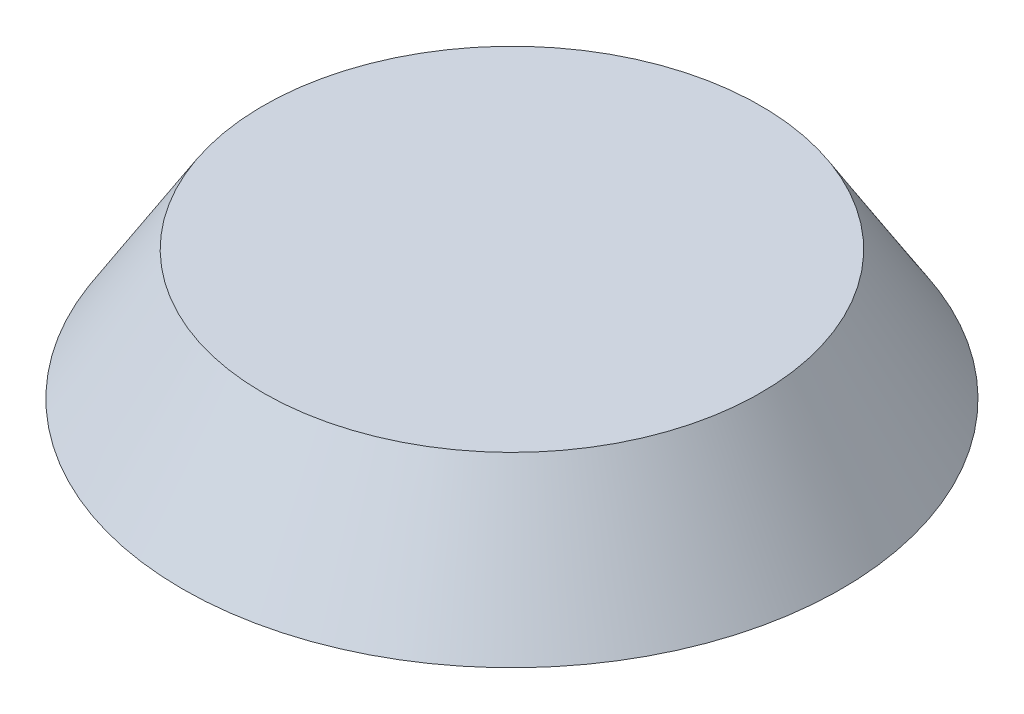
ISO-10303-21;
HEADER;
FILE_DESCRIPTION(('STEP AP214'),'2;1');
FILE_NAME('part.step','',(''),(''),'','','');
FILE_SCHEMA(('AUTOMOTIVE_DESIGN { 1 0 10303 214 1 1 1 1 }'));
ENDSEC;
DATA;
#1=APPLICATION_CONTEXT('core data for automotive mechanical design processes');
#2=APPLICATION_PROTOCOL_DEFINITION('international standard','automotive_design',2000,#1);
#3=PRODUCT_CONTEXT('',#1,'mechanical');
#4=PRODUCT('Part','Part','',(#3));
#5=PRODUCT_RELATED_PRODUCT_CATEGORY('part','',(#4));
#6=PRODUCT_DEFINITION_FORMATION('','',#4);
#7=PRODUCT_DEFINITION_CONTEXT('part definition',#1,'design');
#8=PRODUCT_DEFINITION('design','',#6,#7);
#9=PRODUCT_DEFINITION_SHAPE('','',#8);
#10=(LENGTH_UNIT() NAMED_UNIT(*) SI_UNIT(.MILLI.,.METRE.));
#11=(NAMED_UNIT(*) PLANE_ANGLE_UNIT() SI_UNIT($,.RADIAN.));
#12=(NAMED_UNIT(*) SI_UNIT($,.STERADIAN.) SOLID_ANGLE_UNIT());
#13=UNCERTAINTY_MEASURE_WITH_UNIT(LENGTH_MEASURE(1.E-05),#10,'distance_accuracy_value','');
#14=(GEOMETRIC_REPRESENTATION_CONTEXT(3) GLOBAL_UNCERTAINTY_ASSIGNED_CONTEXT((#13)) GLOBAL_UNIT_ASSIGNED_CONTEXT((#10,
#11,#12)) REPRESENTATION_CONTEXT('',''));
#15=CARTESIAN_POINT('',(0.,0.,0.));
#16=DIRECTION('',(0.,0.,1.));
#17=DIRECTION('',(1.,0.,0.));
#18=AXIS2_PLACEMENT_3D('',#15,#16,#17);
#19=CARTESIAN_POINT('',(0.,2.,0.));
#20=DIRECTION('',(0.,1.,0.));
#21=DIRECTION('',(0.,0.,1.));
#22=AXIS2_PLACEMENT_3D('',#19,#20,#21);
#23=PLANE('',#22);
#24=CARTESIAN_POINT('',(0.,2.,0.));
#25=DIRECTION('',(0.,1.,0.));
#26=DIRECTION('',(0.,0.,1.));
#27=AXIS2_PLACEMENT_3D('',#24,#25,#26);
#28=CIRCLE('',#27,3.8462231302898);
#29=CARTESIAN_POINT('',(0.,2.,3.8462231302898));
#30=VERTEX_POINT('',#29);
#31=EDGE_CURVE('E53',#30,#30,#28,.T.);
#32=ORIENTED_EDGE('',*,*,#31,.T.);
#33=EDGE_LOOP('',(#32));
#34=FACE_BOUND('',#33,.T.);
#35=ADVANCED_FACE('F44',(#34),#23,.T.);
#36=CARTESIAN_POINT('',(0.,0.,0.));
#37=DIRECTION('',(0.,1.,0.));
#38=DIRECTION('',(0.,0.,1.));
#39=AXIS2_PLACEMENT_3D('',#36,#37,#38);
#40=PLANE('',#39);
#41=CARTESIAN_POINT('',(0.,0.,0.));
#42=DIRECTION('',(0.,1.,0.));
#43=DIRECTION('',(0.,0.,1.));
#44=AXIS2_PLACEMENT_3D('',#41,#42,#43);
#45=CIRCLE('',#44,5.09596183410846);
#46=CARTESIAN_POINT('',(0.,0.,5.09596183410846));
#47=VERTEX_POINT('',#46);
#48=EDGE_CURVE('E58',#47,#47,#45,.T.);
#49=ORIENTED_EDGE('',*,*,#48,.F.);
#50=EDGE_LOOP('',(#49));
#51=FACE_BOUND('',#50,.T.);
#52=CARTESIAN_POINT('',(0.,0.,0.));
#53=DIRECTION('',(0.,1.,0.));
#54=DIRECTION('',(0.,0.,1.));
#55=AXIS2_PLACEMENT_3D('',#52,#53,#54);
#56=CIRCLE('',#55,1.22);
#57=CARTESIAN_POINT('',(0.,0.,1.22));
#58=VERTEX_POINT('',#57);
#59=EDGE_CURVE('E61',#58,#58,#56,.T.);
#60=ORIENTED_EDGE('',*,*,#59,.T.);
#61=EDGE_LOOP('',(#60));
#62=FACE_BOUND('',#61,.T.);
#63=ADVANCED_FACE('F91',(#51,#62),#40,.F.);
#64=CARTESIAN_POINT('',(0.,0.,0.));
#65=DIRECTION('',(0.,-1.,0.));
#66=DIRECTION('',(0.,0.,1.));
#67=AXIS2_PLACEMENT_3D('',#64,#65,#66);
#68=CONICAL_SURFACE('',#67,5.09596183410846,0.558505360638186);
#69=ORIENTED_EDGE('',*,*,#31,.F.);
#70=EDGE_LOOP('',(#69));
#71=FACE_BOUND('',#70,.T.);
#72=ORIENTED_EDGE('',*,*,#48,.T.);
#73=EDGE_LOOP('',(#72));
#74=FACE_BOUND('',#73,.T.);
#75=ADVANCED_FACE('F94',(#71,#74),#68,.T.);
#76=CARTESIAN_POINT('',(0.,1.8,0.));
#77=DIRECTION('',(0.,-1.,0.));
#78=DIRECTION('',(0.,0.,-1.));
#79=AXIS2_PLACEMENT_3D('',#76,#77,#78);
#80=CYLINDRICAL_SURFACE('',#79,1.22);
#81=CARTESIAN_POINT('',(0.,1.8,0.));
#82=DIRECTION('',(0.,1.,0.));
#83=DIRECTION('',(0.,0.,1.));
#84=AXIS2_PLACEMENT_3D('',#81,#82,#83);
#85=CIRCLE('',#84,1.22);
#86=CARTESIAN_POINT('',(0.,1.8,1.22));
#87=VERTEX_POINT('',#86);
#88=EDGE_CURVE('E66',#87,#87,#85,.T.);
#89=ORIENTED_EDGE('',*,*,#88,.T.);
#90=EDGE_LOOP('',(#89));
#91=FACE_BOUND('',#90,.T.);
#92=ORIENTED_EDGE('',*,*,#59,.F.);
#93=EDGE_LOOP('',(#92));
#94=FACE_BOUND('',#93,.T.);
#95=ADVANCED_FACE('F97',(#91,#94),#80,.F.);
#96=CARTESIAN_POINT('',(0.,1.8,0.));
#97=DIRECTION('',(0.,1.,0.));
#98=DIRECTION('',(0.,0.,1.));
#99=AXIS2_PLACEMENT_3D('',#96,#97,#98);
#100=PLANE('',#99);
#101=ORIENTED_EDGE('',*,*,#88,.F.);
#102=EDGE_LOOP('',(#101));
#103=FACE_BOUND('',#102,.T.);
#104=ADVANCED_FACE('F86',(#103),#100,.F.);
#105=CLOSED_SHELL('',(#35,#63,#75,#95,#104));
#106=CARTESIAN_POINT('',(0.,1.8,0.));
#107=DIRECTION('',(0.,1.,0.));
#108=DIRECTION('',(0.,0.,1.));
#109=AXIS2_PLACEMENT_3D('',#106,#107,#108);
#110=CIRCLE('',#109,3.44);
#111=CARTESIAN_POINT('',(0.,1.8,3.44));
#112=VERTEX_POINT('',#111);
#113=EDGE_CURVE('E11',#112,#112,#110,.T.);
#114=ORIENTED_EDGE('',*,*,#113,.T.);
#115=EDGE_LOOP('',(#114));
#116=FACE_BOUND('',#115,.T.);
#117=CARTESIAN_POINT('',(0.,1.8,0.));
#118=DIRECTION('',(0.,1.,0.));
#119=DIRECTION('',(0.,0.,1.));
#120=AXIS2_PLACEMENT_3D('',#117,#118,#119);
#121=CIRCLE('',#120,3.56476483343679);
#122=CARTESIAN_POINT('',(0.,1.8,3.56476483343679));
#123=VERTEX_POINT('',#122);
#124=EDGE_CURVE('E63',#123,#123,#121,.T.);
#125=ORIENTED_EDGE('',*,*,#124,.F.);
#126=EDGE_LOOP('',(#125));
#127=FACE_BOUND('',#126,.T.);
#128=ADVANCED_FACE('F78',(#116,#127),#100,.F.);
#129=CARTESIAN_POINT('',(0.,2.,0.));
#130=DIRECTION('',(0.,-1.,0.));
#131=DIRECTION('',(0.,0.,-1.));
#132=AXIS2_PLACEMENT_3D('',#129,#130,#131);
#133=CYLINDRICAL_SURFACE('',#132,3.44);
#134=CARTESIAN_POINT('',(0.,1.60033452904105,0.));
#135=DIRECTION('',(0.,1.,0.));
#136=DIRECTION('',(0.,0.,1.));
#137=AXIS2_PLACEMENT_3D('',#134,#135,#136);
#138=CIRCLE('',#137,3.44);
#139=CARTESIAN_POINT('',(0.,1.60033452904105,3.44));
#140=VERTEX_POINT('',#139);
#141=EDGE_CURVE('E48',#140,#140,#138,.F.);
#142=ORIENTED_EDGE('',*,*,#141,.F.);
#143=EDGE_LOOP('',(#142));
#144=FACE_BOUND('',#143,.T.);
#145=ORIENTED_EDGE('',*,*,#113,.F.);
#146=EDGE_LOOP('',(#145));
#147=FACE_BOUND('',#146,.T.);
#148=ADVANCED_FACE('F75',(#144,#147),#133,.T.);
#149=CARTESIAN_POINT('',(0.,0.,0.));
#150=DIRECTION('',(0.,1.,0.));
#151=DIRECTION('',(0.,0.,1.));
#152=AXIS2_PLACEMENT_3D('',#149,#150,#151);
#153=CONICAL_SURFACE('',#152,2.44,0.558505360638186);
#154=ORIENTED_EDGE('',*,*,#141,.T.);
#155=EDGE_LOOP('',(#154));
#156=FACE_BOUND('',#155,.T.);
#157=ORIENTED_EDGE('',*,*,#124,.T.);
#158=EDGE_LOOP('',(#157));
#159=FACE_BOUND('',#158,.T.);
#160=ADVANCED_FACE('F46',(#156,#159),#153,.F.);
#161=CLOSED_SHELL('',(#128,#148,#160));
#162=ORIENTED_CLOSED_SHELL('',*,#161,.T.);
#163=BREP_WITH_VOIDS('B2',#105,(#162));
#164=ADVANCED_BREP_SHAPE_REPRESENTATION('',(#18,#163),#14);
#165=SHAPE_DEFINITION_REPRESENTATION(#9,#164);
ENDSEC;
END-ISO-10303-21;
